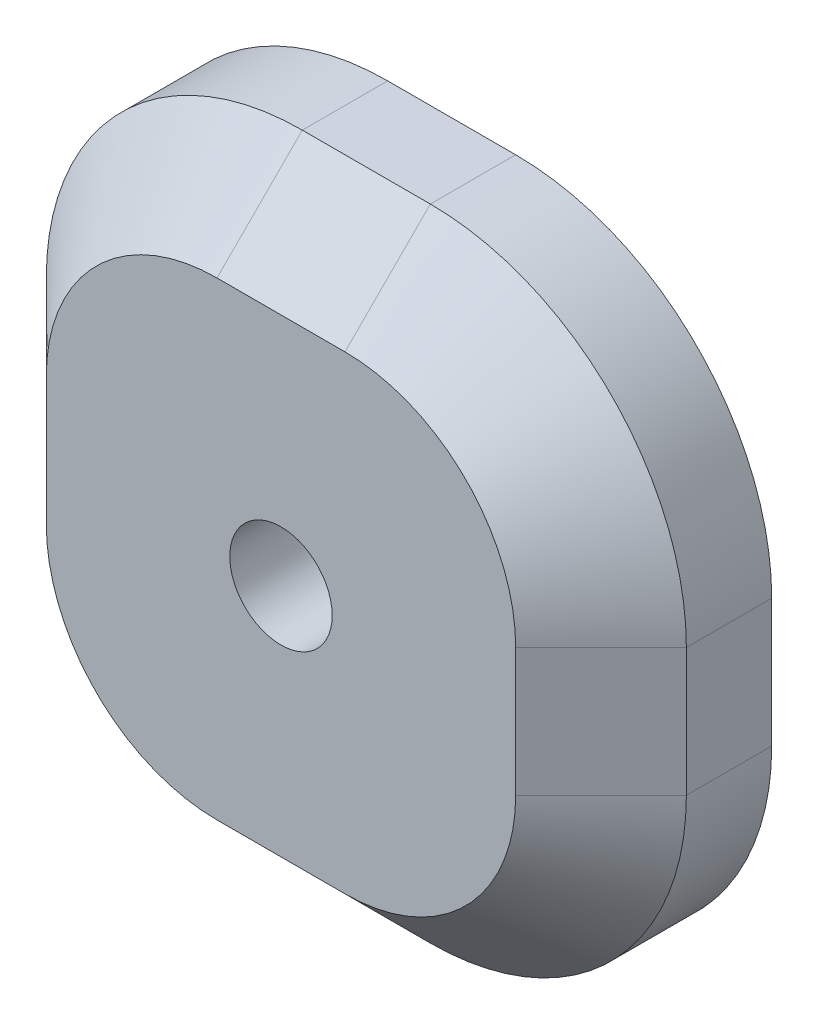
ISO-10303-21;
HEADER;
FILE_DESCRIPTION(('STEP AP214'),'2;1');
FILE_NAME('part.step','',(''),(''),'','','');
FILE_SCHEMA(('AUTOMOTIVE_DESIGN { 1 0 10303 214 1 1 1 1 }'));
ENDSEC;
DATA;
#1=APPLICATION_CONTEXT('core data for automotive mechanical design processes');
#2=APPLICATION_PROTOCOL_DEFINITION('international standard','automotive_design',2000,#1);
#3=PRODUCT_CONTEXT('',#1,'mechanical');
#4=PRODUCT('Part','Part','',(#3));
#5=PRODUCT_RELATED_PRODUCT_CATEGORY('part','',(#4));
#6=PRODUCT_DEFINITION_FORMATION('','',#4);
#7=PRODUCT_DEFINITION_CONTEXT('part definition',#1,'design');
#8=PRODUCT_DEFINITION('design','',#6,#7);
#9=PRODUCT_DEFINITION_SHAPE('','',#8);
#10=(LENGTH_UNIT() NAMED_UNIT(*) SI_UNIT(.MILLI.,.METRE.));
#11=(NAMED_UNIT(*) PLANE_ANGLE_UNIT() SI_UNIT($,.RADIAN.));
#12=(NAMED_UNIT(*) SI_UNIT($,.STERADIAN.) SOLID_ANGLE_UNIT());
#13=UNCERTAINTY_MEASURE_WITH_UNIT(LENGTH_MEASURE(1.E-05),#10,'distance_accuracy_value','');
#14=(GEOMETRIC_REPRESENTATION_CONTEXT(3) GLOBAL_UNCERTAINTY_ASSIGNED_CONTEXT((#13)) GLOBAL_UNIT_ASSIGNED_CONTEXT((#10,
#11,#12)) REPRESENTATION_CONTEXT('',''));
#15=CARTESIAN_POINT('',(0.,0.,0.));
#16=DIRECTION('',(0.,0.,1.));
#17=DIRECTION('',(1.,0.,0.));
#18=AXIS2_PLACEMENT_3D('',#15,#16,#17);
#19=CARTESIAN_POINT('',(-7.5,-7.5,20.));
#20=DIRECTION('',(0.,0.,-1.));
#21=DIRECTION('',(-1.,0.,0.));
#22=AXIS2_PLACEMENT_3D('',#19,#20,#21);
#23=CYLINDRICAL_SURFACE('',#22,30.);
#24=DIRECTION('',(0.,0.,-1.));
#25=VECTOR('',#24,1.);
#26=CARTESIAN_POINT('',(-7.5,-37.5,20.));
#27=LINE('',#26,#25);
#28=CARTESIAN_POINT('',(-7.5,-37.5,9.99999999999995));
#29=VERTEX_POINT('',#28);
#30=CARTESIAN_POINT('',(-7.5,-37.5,0.));
#31=VERTEX_POINT('',#30);
#32=EDGE_CURVE('E249',#29,#31,#27,.T.);
#33=ORIENTED_EDGE('',*,*,#32,.F.);
#34=CARTESIAN_POINT('',(-7.5,-7.5,9.99999999999995));
#35=DIRECTION('',(0.,0.,1.));
#36=DIRECTION('',(1.,0.,0.));
#37=AXIS2_PLACEMENT_3D('',#34,#35,#36);
#38=CIRCLE('',#37,30.);
#39=CARTESIAN_POINT('',(-37.5,-7.5,9.99999999999995));
#40=VERTEX_POINT('',#39);
#41=EDGE_CURVE('E52',#29,#40,#38,.F.);
#42=ORIENTED_EDGE('',*,*,#41,.T.);
#43=DIRECTION('',(0.,0.,-1.));
#44=VECTOR('',#43,1.);
#45=CARTESIAN_POINT('',(-37.5,-7.5,20.));
#46=LINE('',#45,#44);
#47=CARTESIAN_POINT('',(-37.5,-7.5,0.));
#48=VERTEX_POINT('',#47);
#49=EDGE_CURVE('E228',#40,#48,#46,.T.);
#50=ORIENTED_EDGE('',*,*,#49,.T.);
#51=CARTESIAN_POINT('',(-7.5,-7.5,0.));
#52=DIRECTION('',(0.,0.,1.));
#53=DIRECTION('',(1.,0.,0.));
#54=AXIS2_PLACEMENT_3D('',#51,#52,#53);
#55=CIRCLE('',#54,30.);
#56=EDGE_CURVE('E196',#48,#31,#55,.T.);
#57=ORIENTED_EDGE('',*,*,#56,.T.);
#58=EDGE_LOOP('',(#33,#42,#50,#57));
#59=FACE_BOUND('',#58,.T.);
#60=ADVANCED_FACE('F41',(#59),#23,.T.);
#61=CARTESIAN_POINT('',(-7.5,-37.5,20.));
#62=DIRECTION('',(0.,1.,0.));
#63=DIRECTION('',(0.,0.,1.));
#64=AXIS2_PLACEMENT_3D('',#61,#62,#63);
#65=PLANE('',#64);
#66=DIRECTION('',(0.,0.,-1.));
#67=VECTOR('',#66,1.);
#68=CARTESIAN_POINT('',(7.5,-37.5,20.));
#69=LINE('',#68,#67);
#70=CARTESIAN_POINT('',(7.5,-37.5,9.99999999999995));
#71=VERTEX_POINT('',#70);
#72=CARTESIAN_POINT('',(7.5,-37.5,0.));
#73=VERTEX_POINT('',#72);
#74=EDGE_CURVE('E246',#71,#73,#69,.T.);
#75=ORIENTED_EDGE('',*,*,#74,.F.);
#76=DIRECTION('',(-1.,0.,0.));
#77=VECTOR('',#76,1.);
#78=CARTESIAN_POINT('',(-7.5,-37.5,9.99999999999995));
#79=LINE('',#78,#77);
#80=EDGE_CURVE('E11',#71,#29,#79,.T.);
#81=ORIENTED_EDGE('',*,*,#80,.T.);
#82=ORIENTED_EDGE('',*,*,#32,.T.);
#83=DIRECTION('',(1.,0.,0.));
#84=VECTOR('',#83,1.);
#85=CARTESIAN_POINT('',(-7.5,-37.5,0.));
#86=LINE('',#85,#84);
#87=EDGE_CURVE('E200',#31,#73,#86,.T.);
#88=ORIENTED_EDGE('',*,*,#87,.T.);
#89=EDGE_LOOP('',(#75,#81,#82,#88));
#90=FACE_BOUND('',#89,.T.);
#91=ADVANCED_FACE('F400',(#90),#65,.F.);
#92=CARTESIAN_POINT('',(7.50000000000001,-7.5,20.));
#93=DIRECTION('',(0.,0.,-1.));
#94=DIRECTION('',(-1.,0.,0.));
#95=AXIS2_PLACEMENT_3D('',#92,#93,#94);
#96=CYLINDRICAL_SURFACE('',#95,30.);
#97=DIRECTION('',(0.,0.,-1.));
#98=VECTOR('',#97,1.);
#99=CARTESIAN_POINT('',(37.5,-7.5,20.));
#100=LINE('',#99,#98);
#101=CARTESIAN_POINT('',(37.5,-7.5,9.99999999999995));
#102=VERTEX_POINT('',#101);
#103=CARTESIAN_POINT('',(37.5,-7.5,0.));
#104=VERTEX_POINT('',#103);
#105=EDGE_CURVE('E243',#102,#104,#100,.T.);
#106=ORIENTED_EDGE('',*,*,#105,.F.);
#107=CARTESIAN_POINT('',(7.50000000000001,-7.5,9.99999999999995));
#108=DIRECTION('',(0.,0.,1.));
#109=DIRECTION('',(1.,0.,0.));
#110=AXIS2_PLACEMENT_3D('',#107,#108,#109);
#111=CIRCLE('',#110,30.);
#112=EDGE_CURVE('E66',#102,#71,#111,.F.);
#113=ORIENTED_EDGE('',*,*,#112,.T.);
#114=ORIENTED_EDGE('',*,*,#74,.T.);
#115=CARTESIAN_POINT('',(7.50000000000001,-7.5,0.));
#116=DIRECTION('',(0.,0.,1.));
#117=DIRECTION('',(1.,0.,0.));
#118=AXIS2_PLACEMENT_3D('',#115,#116,#117);
#119=CIRCLE('',#118,30.);
#120=EDGE_CURVE('E204',#73,#104,#119,.T.);
#121=ORIENTED_EDGE('',*,*,#120,.T.);
#122=EDGE_LOOP('',(#106,#113,#114,#121));
#123=FACE_BOUND('',#122,.T.);
#124=ADVANCED_FACE('F337',(#123),#96,.T.);
#125=CARTESIAN_POINT('',(37.5,7.50000000000001,20.));
#126=DIRECTION('',(-1.,0.,0.));
#127=DIRECTION('',(0.,-1.,0.));
#128=AXIS2_PLACEMENT_3D('',#125,#126,#127);
#129=PLANE('',#128);
#130=DIRECTION('',(0.,0.,-1.));
#131=VECTOR('',#130,1.);
#132=CARTESIAN_POINT('',(37.5,7.5,20.));
#133=LINE('',#132,#131);
#134=CARTESIAN_POINT('',(37.5,7.5,9.99999999999995));
#135=VERTEX_POINT('',#134);
#136=CARTESIAN_POINT('',(37.5,7.5,0.));
#137=VERTEX_POINT('',#136);
#138=EDGE_CURVE('E240',#135,#137,#133,.T.);
#139=ORIENTED_EDGE('',*,*,#138,.F.);
#140=DIRECTION('',(0.,-1.,0.));
#141=VECTOR('',#140,1.);
#142=CARTESIAN_POINT('',(37.5,-7.5,9.99999999999995));
#143=LINE('',#142,#141);
#144=EDGE_CURVE('E290',#135,#102,#143,.T.);
#145=ORIENTED_EDGE('',*,*,#144,.T.);
#146=ORIENTED_EDGE('',*,*,#105,.T.);
#147=DIRECTION('',(0.,1.,0.));
#148=VECTOR('',#147,1.);
#149=CARTESIAN_POINT('',(37.5,7.50000000000001,0.));
#150=LINE('',#149,#148);
#151=EDGE_CURVE('E208',#104,#137,#150,.T.);
#152=ORIENTED_EDGE('',*,*,#151,.T.);
#153=EDGE_LOOP('',(#139,#145,#146,#152));
#154=FACE_BOUND('',#153,.T.);
#155=ADVANCED_FACE('F336',(#154),#129,.F.);
#156=CARTESIAN_POINT('',(7.49999999999999,7.5,20.));
#157=DIRECTION('',(0.,0.,-1.));
#158=DIRECTION('',(-1.,0.,0.));
#159=AXIS2_PLACEMENT_3D('',#156,#157,#158);
#160=CYLINDRICAL_SURFACE('',#159,30.);
#161=DIRECTION('',(0.,0.,-1.));
#162=VECTOR('',#161,1.);
#163=CARTESIAN_POINT('',(7.49999999999999,37.5,20.));
#164=LINE('',#163,#162);
#165=CARTESIAN_POINT('',(7.49999999999999,37.5,9.99999999999995));
#166=VERTEX_POINT('',#165);
#167=CARTESIAN_POINT('',(7.49999999999999,37.5,0.));
#168=VERTEX_POINT('',#167);
#169=EDGE_CURVE('E237',#166,#168,#164,.T.);
#170=ORIENTED_EDGE('',*,*,#169,.F.);
#171=CARTESIAN_POINT('',(7.49999999999999,7.5,9.99999999999995));
#172=DIRECTION('',(0.,0.,1.));
#173=DIRECTION('',(1.,0.,0.));
#174=AXIS2_PLACEMENT_3D('',#171,#172,#173);
#175=CIRCLE('',#174,30.);
#176=EDGE_CURVE('E287',#166,#135,#175,.F.);
#177=ORIENTED_EDGE('',*,*,#176,.T.);
#178=ORIENTED_EDGE('',*,*,#138,.T.);
#179=CARTESIAN_POINT('',(7.49999999999999,7.5,0.));
#180=DIRECTION('',(0.,0.,1.));
#181=DIRECTION('',(-1.,0.,0.));
#182=AXIS2_PLACEMENT_3D('',#179,#180,#181);
#183=CIRCLE('',#182,30.);
#184=EDGE_CURVE('E212',#137,#168,#183,.T.);
#185=ORIENTED_EDGE('',*,*,#184,.T.);
#186=EDGE_LOOP('',(#170,#177,#178,#185));
#187=FACE_BOUND('',#186,.T.);
#188=ADVANCED_FACE('F349',(#187),#160,.T.);
#189=CARTESIAN_POINT('',(-7.5,37.5,20.));
#190=DIRECTION('',(0.,-1.,0.));
#191=DIRECTION('',(0.,0.,-1.));
#192=AXIS2_PLACEMENT_3D('',#189,#190,#191);
#193=PLANE('',#192);
#194=DIRECTION('',(0.,0.,-1.));
#195=VECTOR('',#194,1.);
#196=CARTESIAN_POINT('',(-7.5,37.5,20.));
#197=LINE('',#196,#195);
#198=CARTESIAN_POINT('',(-7.5,37.5,9.99999999999995));
#199=VERTEX_POINT('',#198);
#200=CARTESIAN_POINT('',(-7.5,37.5,0.));
#201=VERTEX_POINT('',#200);
#202=EDGE_CURVE('E234',#199,#201,#197,.T.);
#203=ORIENTED_EDGE('',*,*,#202,.F.);
#204=DIRECTION('',(1.,0.,0.));
#205=VECTOR('',#204,1.);
#206=CARTESIAN_POINT('',(7.49999999999999,37.5,9.99999999999995));
#207=LINE('',#206,#205);
#208=EDGE_CURVE('E284',#199,#166,#207,.T.);
#209=ORIENTED_EDGE('',*,*,#208,.T.);
#210=ORIENTED_EDGE('',*,*,#169,.T.);
#211=DIRECTION('',(-1.,0.,0.));
#212=VECTOR('',#211,1.);
#213=CARTESIAN_POINT('',(-7.5,37.5,0.));
#214=LINE('',#213,#212);
#215=EDGE_CURVE('E216',#168,#201,#214,.T.);
#216=ORIENTED_EDGE('',*,*,#215,.T.);
#217=EDGE_LOOP('',(#203,#209,#210,#216));
#218=FACE_BOUND('',#217,.T.);
#219=ADVANCED_FACE('F352',(#218),#193,.F.);
#220=CARTESIAN_POINT('',(-7.5,7.5,20.));
#221=DIRECTION('',(0.,0.,-1.));
#222=DIRECTION('',(-1.,0.,0.));
#223=AXIS2_PLACEMENT_3D('',#220,#221,#222);
#224=CYLINDRICAL_SURFACE('',#223,30.);
#225=DIRECTION('',(0.,0.,-1.));
#226=VECTOR('',#225,1.);
#227=CARTESIAN_POINT('',(-37.5,7.49999999999999,20.));
#228=LINE('',#227,#226);
#229=CARTESIAN_POINT('',(-37.5,7.49999999999999,9.99999999999995));
#230=VERTEX_POINT('',#229);
#231=CARTESIAN_POINT('',(-37.5,7.49999999999999,0.));
#232=VERTEX_POINT('',#231);
#233=EDGE_CURVE('E231',#230,#232,#228,.T.);
#234=ORIENTED_EDGE('',*,*,#233,.F.);
#235=CARTESIAN_POINT('',(-7.5,7.5,9.99999999999995));
#236=DIRECTION('',(0.,0.,1.));
#237=DIRECTION('',(1.,0.,0.));
#238=AXIS2_PLACEMENT_3D('',#235,#236,#237);
#239=CIRCLE('',#238,30.);
#240=EDGE_CURVE('E281',#230,#199,#239,.F.);
#241=ORIENTED_EDGE('',*,*,#240,.T.);
#242=ORIENTED_EDGE('',*,*,#202,.T.);
#243=CARTESIAN_POINT('',(-7.5,7.5,0.));
#244=DIRECTION('',(0.,0.,1.));
#245=DIRECTION('',(1.,0.,0.));
#246=AXIS2_PLACEMENT_3D('',#243,#244,#245);
#247=CIRCLE('',#246,30.);
#248=EDGE_CURVE('E220',#201,#232,#247,.T.);
#249=ORIENTED_EDGE('',*,*,#248,.T.);
#250=EDGE_LOOP('',(#234,#241,#242,#249));
#251=FACE_BOUND('',#250,.T.);
#252=ADVANCED_FACE('F414',(#251),#224,.T.);
#253=CARTESIAN_POINT('',(-37.5,7.49999999999999,20.));
#254=DIRECTION('',(1.,0.,0.));
#255=DIRECTION('',(0.,1.,0.));
#256=AXIS2_PLACEMENT_3D('',#253,#254,#255);
#257=PLANE('',#256);
#258=ORIENTED_EDGE('',*,*,#49,.F.);
#259=DIRECTION('',(0.,1.,0.));
#260=VECTOR('',#259,1.);
#261=CARTESIAN_POINT('',(-37.5,7.49999999999999,9.99999999999995));
#262=LINE('',#261,#260);
#263=EDGE_CURVE('E277',#40,#230,#262,.T.);
#264=ORIENTED_EDGE('',*,*,#263,.T.);
#265=ORIENTED_EDGE('',*,*,#233,.T.);
#266=DIRECTION('',(0.,-1.,0.));
#267=VECTOR('',#266,1.);
#268=CARTESIAN_POINT('',(-37.5,7.49999999999999,0.));
#269=LINE('',#268,#267);
#270=EDGE_CURVE('E224',#232,#48,#269,.T.);
#271=ORIENTED_EDGE('',*,*,#270,.T.);
#272=EDGE_LOOP('',(#258,#264,#265,#271));
#273=FACE_BOUND('',#272,.T.);
#274=ADVANCED_FACE('F381',(#273),#257,.F.);
#275=CARTESIAN_POINT('',(-7.5,-7.5,20.));
#276=DIRECTION('',(0.,0.,1.));
#277=DIRECTION('',(1.,0.,0.));
#278=AXIS2_PLACEMENT_3D('',#275,#276,#277);
#279=PLANE('',#278);
#280=CARTESIAN_POINT('',(0.,0.,20.));
#281=DIRECTION('',(0.,0.,1.));
#282=DIRECTION('',(1.,0.,0.));
#283=AXIS2_PLACEMENT_3D('',#280,#281,#282);
#284=CIRCLE('',#283,6.);
#285=CARTESIAN_POINT('',(6.,0.,20.));
#286=VERTEX_POINT('',#285);
#287=EDGE_CURVE('E158',#286,#286,#284,.T.);
#288=ORIENTED_EDGE('',*,*,#287,.F.);
#289=EDGE_LOOP('',(#288));
#290=FACE_BOUND('',#289,.T.);
#291=CARTESIAN_POINT('',(-7.5,7.5,20.));
#292=DIRECTION('',(0.,0.,1.));
#293=DIRECTION('',(1.,0.,0.));
#294=AXIS2_PLACEMENT_3D('',#291,#292,#293);
#295=CIRCLE('',#294,20.);
#296=CARTESIAN_POINT('',(-7.5,27.5,20.));
#297=VERTEX_POINT('',#296);
#298=CARTESIAN_POINT('',(-27.5,7.5,20.));
#299=VERTEX_POINT('',#298);
#300=EDGE_CURVE('E270',#297,#299,#295,.T.);
#301=ORIENTED_EDGE('',*,*,#300,.T.);
#302=DIRECTION('',(0.,-1.,0.));
#303=VECTOR('',#302,1.);
#304=CARTESIAN_POINT('',(-27.5,-7.5,20.));
#305=LINE('',#304,#303);
#306=CARTESIAN_POINT('',(-27.5,-7.5,20.));
#307=VERTEX_POINT('',#306);
#308=EDGE_CURVE('E273',#299,#307,#305,.T.);
#309=ORIENTED_EDGE('',*,*,#308,.T.);
#310=CARTESIAN_POINT('',(-7.5,-7.5,20.));
#311=DIRECTION('',(0.,0.,1.));
#312=DIRECTION('',(1.,0.,0.));
#313=AXIS2_PLACEMENT_3D('',#310,#311,#312);
#314=CIRCLE('',#313,20.);
#315=CARTESIAN_POINT('',(-7.5,-27.5,20.));
#316=VERTEX_POINT('',#315);
#317=EDGE_CURVE('E255',#307,#316,#314,.T.);
#318=ORIENTED_EDGE('',*,*,#317,.T.);
#319=DIRECTION('',(1.,0.,0.));
#320=VECTOR('',#319,1.);
#321=CARTESIAN_POINT('',(7.5,-27.5,20.));
#322=LINE('',#321,#320);
#323=CARTESIAN_POINT('',(7.5,-27.5,20.));
#324=VERTEX_POINT('',#323);
#325=EDGE_CURVE('E252',#316,#324,#322,.T.);
#326=ORIENTED_EDGE('',*,*,#325,.T.);
#327=CARTESIAN_POINT('',(7.50000000000001,-7.5,20.));
#328=DIRECTION('',(0.,0.,1.));
#329=DIRECTION('',(1.,0.,0.));
#330=AXIS2_PLACEMENT_3D('',#327,#328,#329);
#331=CIRCLE('',#330,20.);
#332=CARTESIAN_POINT('',(27.5,-7.5,20.));
#333=VERTEX_POINT('',#332);
#334=EDGE_CURVE('E258',#324,#333,#331,.T.);
#335=ORIENTED_EDGE('',*,*,#334,.T.);
#336=DIRECTION('',(0.,1.,0.));
#337=VECTOR('',#336,1.);
#338=CARTESIAN_POINT('',(27.5,7.5,20.));
#339=LINE('',#338,#337);
#340=CARTESIAN_POINT('',(27.5,7.5,20.));
#341=VERTEX_POINT('',#340);
#342=EDGE_CURVE('E261',#333,#341,#339,.T.);
#343=ORIENTED_EDGE('',*,*,#342,.T.);
#344=CARTESIAN_POINT('',(7.49999999999999,7.5,20.));
#345=DIRECTION('',(0.,0.,1.));
#346=DIRECTION('',(1.,0.,0.));
#347=AXIS2_PLACEMENT_3D('',#344,#345,#346);
#348=CIRCLE('',#347,20.);
#349=CARTESIAN_POINT('',(7.49999999999999,27.5,20.));
#350=VERTEX_POINT('',#349);
#351=EDGE_CURVE('E264',#341,#350,#348,.T.);
#352=ORIENTED_EDGE('',*,*,#351,.T.);
#353=DIRECTION('',(-1.,0.,0.));
#354=VECTOR('',#353,1.);
#355=CARTESIAN_POINT('',(-7.5,27.5,20.));
#356=LINE('',#355,#354);
#357=EDGE_CURVE('E267',#350,#297,#356,.T.);
#358=ORIENTED_EDGE('',*,*,#357,.T.);
#359=EDGE_LOOP('',(#301,#309,#318,#326,#335,#343,#352,#358));
#360=FACE_BOUND('',#359,.T.);
#361=ADVANCED_FACE('F365',(#290,#360),#279,.T.);
#362=CARTESIAN_POINT('',(-7.5,-7.5,0.));
#363=DIRECTION('',(0.,0.,1.));
#364=DIRECTION('',(1.,0.,0.));
#365=AXIS2_PLACEMENT_3D('',#362,#363,#364);
#366=PLANE('',#365);
#367=CARTESIAN_POINT('',(12.5,12.5,0.));
#368=DIRECTION('',(0.,0.,-1.));
#369=DIRECTION('',(-1.,0.,0.));
#370=AXIS2_PLACEMENT_3D('',#367,#368,#369);
#371=CIRCLE('',#370,6.);
#372=CARTESIAN_POINT('',(6.5,12.5,0.));
#373=VERTEX_POINT('',#372);
#374=EDGE_CURVE('E157',#373,#373,#371,.T.);
#375=ORIENTED_EDGE('',*,*,#374,.F.);
#376=EDGE_LOOP('',(#375));
#377=FACE_BOUND('',#376,.T.);
#378=CARTESIAN_POINT('',(12.5,-12.5,0.));
#379=DIRECTION('',(0.,0.,-1.));
#380=DIRECTION('',(-1.,0.,0.));
#381=AXIS2_PLACEMENT_3D('',#378,#379,#380);
#382=CIRCLE('',#381,6.);
#383=CARTESIAN_POINT('',(6.50000000000001,-12.5,0.));
#384=VERTEX_POINT('',#383);
#385=EDGE_CURVE('E171',#384,#384,#382,.T.);
#386=ORIENTED_EDGE('',*,*,#385,.F.);
#387=EDGE_LOOP('',(#386));
#388=FACE_BOUND('',#387,.T.);
#389=CARTESIAN_POINT('',(-12.5,-12.5,0.));
#390=DIRECTION('',(0.,0.,-1.));
#391=DIRECTION('',(-1.,0.,0.));
#392=AXIS2_PLACEMENT_3D('',#389,#390,#391);
#393=CIRCLE('',#392,6.);
#394=CARTESIAN_POINT('',(-18.5,-12.5,0.));
#395=VERTEX_POINT('',#394);
#396=EDGE_CURVE('E179',#395,#395,#393,.T.);
#397=ORIENTED_EDGE('',*,*,#396,.F.);
#398=EDGE_LOOP('',(#397));
#399=FACE_BOUND('',#398,.T.);
#400=CARTESIAN_POINT('',(-12.5,12.5,0.));
#401=DIRECTION('',(0.,0.,-1.));
#402=DIRECTION('',(-1.,0.,0.));
#403=AXIS2_PLACEMENT_3D('',#400,#401,#402);
#404=CIRCLE('',#403,6.);
#405=CARTESIAN_POINT('',(-18.5,12.5,0.));
#406=VERTEX_POINT('',#405);
#407=EDGE_CURVE('E187',#406,#406,#404,.T.);
#408=ORIENTED_EDGE('',*,*,#407,.F.);
#409=EDGE_LOOP('',(#408));
#410=FACE_BOUND('',#409,.T.);
#411=ORIENTED_EDGE('',*,*,#56,.F.);
#412=ORIENTED_EDGE('',*,*,#270,.F.);
#413=ORIENTED_EDGE('',*,*,#248,.F.);
#414=ORIENTED_EDGE('',*,*,#215,.F.);
#415=ORIENTED_EDGE('',*,*,#184,.F.);
#416=ORIENTED_EDGE('',*,*,#151,.F.);
#417=ORIENTED_EDGE('',*,*,#120,.F.);
#418=ORIENTED_EDGE('',*,*,#87,.F.);
#419=EDGE_LOOP('',(#411,#412,#413,#414,#415,#416,#417,#418));
#420=FACE_BOUND('',#419,.T.);
#421=ADVANCED_FACE('F344',(#377,#388,#399,#410,#420),#366,.F.);
#422=CARTESIAN_POINT('',(27.5,-7.49999999999998,20.));
#423=DIRECTION('',(0.707106781186549,0.,0.707106781186546));
#424=DIRECTION('',(0.,-1.,0.));
#425=AXIS2_PLACEMENT_3D('',#422,#423,#424);
#426=PLANE('',#425);
#427=DIRECTION('',(-0.707106781186546,0.,0.707106781186549));
#428=VECTOR('',#427,1.);
#429=CARTESIAN_POINT('',(37.5,-7.5,9.99999999999995));
#430=LINE('',#429,#428);
#431=EDGE_CURVE('E317',#102,#333,#430,.T.);
#432=ORIENTED_EDGE('',*,*,#431,.F.);
#433=ORIENTED_EDGE('',*,*,#144,.F.);
#434=DIRECTION('',(0.707106781186546,0.,-0.707106781186549));
#435=VECTOR('',#434,1.);
#436=CARTESIAN_POINT('',(27.5,7.5,20.));
#437=LINE('',#436,#435);
#438=EDGE_CURVE('E46',#341,#135,#437,.T.);
#439=ORIENTED_EDGE('',*,*,#438,.F.);
#440=ORIENTED_EDGE('',*,*,#342,.F.);
#441=EDGE_LOOP('',(#432,#433,#439,#440));
#442=FACE_BOUND('',#441,.T.);
#443=ADVANCED_FACE('F44',(#442),#426,.T.);
#444=CARTESIAN_POINT('',(7.49999999999999,7.5,20.));
#445=DIRECTION('',(0.,0.,-1.));
#446=DIRECTION('',(-1.,0.,0.));
#447=AXIS2_PLACEMENT_3D('',#444,#445,#446);
#448=CONICAL_SURFACE('',#447,20.,0.785398163397446);
#449=ORIENTED_EDGE('',*,*,#438,.T.);
#450=ORIENTED_EDGE('',*,*,#176,.F.);
#451=DIRECTION('',(0.,0.707106781186546,-0.707106781186549));
#452=VECTOR('',#451,1.);
#453=CARTESIAN_POINT('',(7.49999999999999,27.5,20.));
#454=LINE('',#453,#452);
#455=EDGE_CURVE('E314',#350,#166,#454,.T.);
#456=ORIENTED_EDGE('',*,*,#455,.F.);
#457=ORIENTED_EDGE('',*,*,#351,.F.);
#458=EDGE_LOOP('',(#449,#450,#456,#457));
#459=FACE_BOUND('',#458,.T.);
#460=ADVANCED_FACE('F329',(#459),#448,.T.);
#461=CARTESIAN_POINT('',(7.50000000000001,-7.5,20.));
#462=DIRECTION('',(0.,0.,-1.));
#463=DIRECTION('',(-1.,0.,0.));
#464=AXIS2_PLACEMENT_3D('',#461,#462,#463);
#465=CONICAL_SURFACE('',#464,20.,0.785398163397446);
#466=ORIENTED_EDGE('',*,*,#431,.T.);
#467=ORIENTED_EDGE('',*,*,#334,.F.);
#468=DIRECTION('',(0.,0.707106781186546,0.707106781186549));
#469=VECTOR('',#468,1.);
#470=CARTESIAN_POINT('',(7.5,-37.5,9.99999999999995));
#471=LINE('',#470,#469);
#472=EDGE_CURVE('E310',#71,#324,#471,.T.);
#473=ORIENTED_EDGE('',*,*,#472,.F.);
#474=ORIENTED_EDGE('',*,*,#112,.F.);
#475=EDGE_LOOP('',(#466,#467,#473,#474));
#476=FACE_BOUND('',#475,.T.);
#477=ADVANCED_FACE('F368',(#476),#465,.T.);
#478=CARTESIAN_POINT('',(-7.5,27.5,20.));
#479=DIRECTION('',(0.,0.707106781186549,0.707106781186546));
#480=DIRECTION('',(1.,0.,0.));
#481=AXIS2_PLACEMENT_3D('',#478,#479,#480);
#482=PLANE('',#481);
#483=ORIENTED_EDGE('',*,*,#455,.T.);
#484=ORIENTED_EDGE('',*,*,#208,.F.);
#485=DIRECTION('',(0.,0.707106781186546,-0.707106781186549));
#486=VECTOR('',#485,1.);
#487=CARTESIAN_POINT('',(-7.5,27.5,20.));
#488=LINE('',#487,#486);
#489=EDGE_CURVE('E306',#297,#199,#488,.T.);
#490=ORIENTED_EDGE('',*,*,#489,.F.);
#491=ORIENTED_EDGE('',*,*,#357,.F.);
#492=EDGE_LOOP('',(#483,#484,#490,#491));
#493=FACE_BOUND('',#492,.T.);
#494=ADVANCED_FACE('F356',(#493),#482,.T.);
#495=CARTESIAN_POINT('',(-7.5,-27.5,20.));
#496=DIRECTION('',(0.,-0.707106781186549,0.707106781186546));
#497=DIRECTION('',(-1.,0.,0.));
#498=AXIS2_PLACEMENT_3D('',#495,#496,#497);
#499=PLANE('',#498);
#500=ORIENTED_EDGE('',*,*,#472,.T.);
#501=ORIENTED_EDGE('',*,*,#325,.F.);
#502=DIRECTION('',(0.,0.707106781186546,0.707106781186549));
#503=VECTOR('',#502,1.);
#504=CARTESIAN_POINT('',(-7.5,-37.5,9.99999999999995));
#505=LINE('',#504,#503);
#506=EDGE_CURVE('E302',#29,#316,#505,.T.);
#507=ORIENTED_EDGE('',*,*,#506,.F.);
#508=ORIENTED_EDGE('',*,*,#80,.F.);
#509=EDGE_LOOP('',(#500,#501,#507,#508));
#510=FACE_BOUND('',#509,.T.);
#511=ADVANCED_FACE('F370',(#510),#499,.T.);
#512=CARTESIAN_POINT('',(-7.5,7.5,20.));
#513=DIRECTION('',(0.,0.,-1.));
#514=DIRECTION('',(-1.,0.,0.));
#515=AXIS2_PLACEMENT_3D('',#512,#513,#514);
#516=CONICAL_SURFACE('',#515,20.,0.785398163397446);
#517=ORIENTED_EDGE('',*,*,#489,.T.);
#518=ORIENTED_EDGE('',*,*,#240,.F.);
#519=DIRECTION('',(-0.707106781186546,0.,-0.707106781186549));
#520=VECTOR('',#519,1.);
#521=CARTESIAN_POINT('',(-27.5,7.5,20.));
#522=LINE('',#521,#520);
#523=EDGE_CURVE('E299',#299,#230,#522,.T.);
#524=ORIENTED_EDGE('',*,*,#523,.F.);
#525=ORIENTED_EDGE('',*,*,#300,.F.);
#526=EDGE_LOOP('',(#517,#518,#524,#525));
#527=FACE_BOUND('',#526,.T.);
#528=ADVANCED_FACE('F361',(#527),#516,.T.);
#529=CARTESIAN_POINT('',(-7.5,-7.5,20.));
#530=DIRECTION('',(0.,0.,-1.));
#531=DIRECTION('',(-1.,0.,0.));
#532=AXIS2_PLACEMENT_3D('',#529,#530,#531);
#533=CONICAL_SURFACE('',#532,20.,0.785398163397446);
#534=ORIENTED_EDGE('',*,*,#506,.T.);
#535=ORIENTED_EDGE('',*,*,#317,.F.);
#536=DIRECTION('',(0.707106781186546,0.,0.707106781186549));
#537=VECTOR('',#536,1.);
#538=CARTESIAN_POINT('',(-37.5,-7.5,9.99999999999995));
#539=LINE('',#538,#537);
#540=EDGE_CURVE('E195',#40,#307,#539,.T.);
#541=ORIENTED_EDGE('',*,*,#540,.F.);
#542=ORIENTED_EDGE('',*,*,#41,.F.);
#543=EDGE_LOOP('',(#534,#535,#541,#542));
#544=FACE_BOUND('',#543,.T.);
#545=ADVANCED_FACE('F376',(#544),#533,.T.);
#546=CARTESIAN_POINT('',(-27.5,-7.50000000000001,20.));
#547=DIRECTION('',(-0.707106781186549,0.,0.707106781186546));
#548=DIRECTION('',(0.,1.,0.));
#549=AXIS2_PLACEMENT_3D('',#546,#547,#548);
#550=PLANE('',#549);
#551=ORIENTED_EDGE('',*,*,#523,.T.);
#552=ORIENTED_EDGE('',*,*,#263,.F.);
#553=ORIENTED_EDGE('',*,*,#540,.T.);
#554=ORIENTED_EDGE('',*,*,#308,.F.);
#555=EDGE_LOOP('',(#551,#552,#553,#554));
#556=FACE_BOUND('',#555,.T.);
#557=ADVANCED_FACE('F385',(#556),#550,.T.);
#558=CARTESIAN_POINT('',(-12.5,12.5,9.99999999999999));
#559=DIRECTION('',(0.,0.,-1.));
#560=DIRECTION('',(-1.,0.,0.));
#561=AXIS2_PLACEMENT_3D('',#558,#559,#560);
#562=CONICAL_SURFACE('',#561,6.,1.02974425867666);
#563=CARTESIAN_POINT('',(-12.5,12.5,13.6051637141653));
#564=VERTEX_POINT('',#563);
#565=VERTEX_LOOP('',#564);
#566=FACE_BOUND('',#565,.T.);
#567=CARTESIAN_POINT('',(-12.5,12.5,9.99999999999999));
#568=DIRECTION('',(0.,0.,-1.));
#569=DIRECTION('',(-1.,0.,0.));
#570=AXIS2_PLACEMENT_3D('',#567,#568,#569);
#571=CIRCLE('',#570,6.);
#572=CARTESIAN_POINT('',(-18.5,12.5,9.99999999999999));
#573=VERTEX_POINT('',#572);
#574=EDGE_CURVE('E191',#573,#573,#571,.T.);
#575=ORIENTED_EDGE('',*,*,#574,.T.);
#576=EDGE_LOOP('',(#575));
#577=FACE_BOUND('',#576,.T.);
#578=ADVANCED_FACE('F387',(#566,#577),#562,.F.);
#579=CARTESIAN_POINT('',(-12.5,12.5,0.));
#580=DIRECTION('',(0.,0.,-1.));
#581=DIRECTION('',(-1.,0.,0.));
#582=AXIS2_PLACEMENT_3D('',#579,#580,#581);
#583=CYLINDRICAL_SURFACE('',#582,6.);
#584=ORIENTED_EDGE('',*,*,#574,.F.);
#585=EDGE_LOOP('',(#584));
#586=FACE_BOUND('',#585,.T.);
#587=ORIENTED_EDGE('',*,*,#407,.T.);
#588=EDGE_LOOP('',(#587));
#589=FACE_BOUND('',#588,.T.);
#590=ADVANCED_FACE('F393',(#586,#589),#583,.F.);
#591=CARTESIAN_POINT('',(-12.5,-12.5,9.99999999999999));
#592=DIRECTION('',(0.,0.,-1.));
#593=DIRECTION('',(-1.,0.,0.));
#594=AXIS2_PLACEMENT_3D('',#591,#592,#593);
#595=CONICAL_SURFACE('',#594,6.,1.02974425867666);
#596=CARTESIAN_POINT('',(-12.5,-12.5,13.6051637141653));
#597=VERTEX_POINT('',#596);
#598=VERTEX_LOOP('',#597);
#599=FACE_BOUND('',#598,.T.);
#600=CARTESIAN_POINT('',(-12.5,-12.5,9.99999999999999));
#601=DIRECTION('',(0.,0.,-1.));
#602=DIRECTION('',(-1.,0.,0.));
#603=AXIS2_PLACEMENT_3D('',#600,#601,#602);
#604=CIRCLE('',#603,6.);
#605=CARTESIAN_POINT('',(-18.5,-12.5,9.99999999999999));
#606=VERTEX_POINT('',#605);
#607=EDGE_CURVE('E183',#606,#606,#604,.T.);
#608=ORIENTED_EDGE('',*,*,#607,.T.);
#609=EDGE_LOOP('',(#608));
#610=FACE_BOUND('',#609,.T.);
#611=ADVANCED_FACE('F428',(#599,#610),#595,.F.);
#612=CARTESIAN_POINT('',(-12.5,-12.5,0.));
#613=DIRECTION('',(0.,0.,-1.));
#614=DIRECTION('',(-1.,0.,0.));
#615=AXIS2_PLACEMENT_3D('',#612,#613,#614);
#616=CYLINDRICAL_SURFACE('',#615,6.);
#617=ORIENTED_EDGE('',*,*,#607,.F.);
#618=EDGE_LOOP('',(#617));
#619=FACE_BOUND('',#618,.T.);
#620=ORIENTED_EDGE('',*,*,#396,.T.);
#621=EDGE_LOOP('',(#620));
#622=FACE_BOUND('',#621,.T.);
#623=ADVANCED_FACE('F432',(#619,#622),#616,.F.);
#624=CARTESIAN_POINT('',(12.5,-12.5,9.99999999999999));
#625=DIRECTION('',(0.,0.,-1.));
#626=DIRECTION('',(-1.,0.,0.));
#627=AXIS2_PLACEMENT_3D('',#624,#625,#626);
#628=CONICAL_SURFACE('',#627,6.,1.02974425867666);
#629=CARTESIAN_POINT('',(12.5,-12.5,13.6051637141653));
#630=VERTEX_POINT('',#629);
#631=VERTEX_LOOP('',#630);
#632=FACE_BOUND('',#631,.T.);
#633=CARTESIAN_POINT('',(12.5,-12.5,9.99999999999999));
#634=DIRECTION('',(0.,0.,-1.));
#635=DIRECTION('',(-1.,0.,0.));
#636=AXIS2_PLACEMENT_3D('',#633,#634,#635);
#637=CIRCLE('',#636,6.);
#638=CARTESIAN_POINT('',(6.50000000000001,-12.5,9.99999999999999));
#639=VERTEX_POINT('',#638);
#640=EDGE_CURVE('E175',#639,#639,#637,.T.);
#641=ORIENTED_EDGE('',*,*,#640,.T.);
#642=EDGE_LOOP('',(#641));
#643=FACE_BOUND('',#642,.T.);
#644=ADVANCED_FACE('F436',(#632,#643),#628,.F.);
#645=CARTESIAN_POINT('',(12.5,-12.5,0.));
#646=DIRECTION('',(0.,0.,-1.));
#647=DIRECTION('',(-1.,0.,0.));
#648=AXIS2_PLACEMENT_3D('',#645,#646,#647);
#649=CYLINDRICAL_SURFACE('',#648,6.);
#650=ORIENTED_EDGE('',*,*,#640,.F.);
#651=EDGE_LOOP('',(#650));
#652=FACE_BOUND('',#651,.T.);
#653=ORIENTED_EDGE('',*,*,#385,.T.);
#654=EDGE_LOOP('',(#653));
#655=FACE_BOUND('',#654,.T.);
#656=ADVANCED_FACE('F440',(#652,#655),#649,.F.);
#657=CARTESIAN_POINT('',(12.5,12.5,9.99999999999999));
#658=DIRECTION('',(0.,0.,-1.));
#659=DIRECTION('',(-1.,0.,0.));
#660=AXIS2_PLACEMENT_3D('',#657,#658,#659);
#661=CONICAL_SURFACE('',#660,6.,1.02974425867666);
#662=CARTESIAN_POINT('',(12.5,12.5,13.6051637141653));
#663=VERTEX_POINT('',#662);
#664=VERTEX_LOOP('',#663);
#665=FACE_BOUND('',#664,.T.);
#666=CARTESIAN_POINT('',(12.5,12.5,9.99999999999999));
#667=DIRECTION('',(0.,0.,-1.));
#668=DIRECTION('',(-1.,0.,0.));
#669=AXIS2_PLACEMENT_3D('',#666,#667,#668);
#670=CIRCLE('',#669,6.);
#671=CARTESIAN_POINT('',(6.5,12.5,9.99999999999999));
#672=VERTEX_POINT('',#671);
#673=EDGE_CURVE('E163',#672,#672,#670,.T.);
#674=ORIENTED_EDGE('',*,*,#673,.T.);
#675=EDGE_LOOP('',(#674));
#676=FACE_BOUND('',#675,.T.);
#677=ADVANCED_FACE('F444',(#665,#676),#661,.F.);
#678=CARTESIAN_POINT('',(12.5,12.5,0.));
#679=DIRECTION('',(0.,0.,-1.));
#680=DIRECTION('',(-1.,0.,0.));
#681=AXIS2_PLACEMENT_3D('',#678,#679,#680);
#682=CYLINDRICAL_SURFACE('',#681,6.);
#683=ORIENTED_EDGE('',*,*,#673,.F.);
#684=EDGE_LOOP('',(#683));
#685=FACE_BOUND('',#684,.T.);
#686=ORIENTED_EDGE('',*,*,#374,.T.);
#687=EDGE_LOOP('',(#686));
#688=FACE_BOUND('',#687,.T.);
#689=ADVANCED_FACE('F150',(#685,#688),#682,.F.);
#690=CARTESIAN_POINT('',(0.,0.,10.));
#691=DIRECTION('',(0.,0.,1.));
#692=DIRECTION('',(1.,0.,0.));
#693=AXIS2_PLACEMENT_3D('',#690,#691,#692);
#694=CONICAL_SURFACE('',#693,6.,1.02974425867666);
#695=CARTESIAN_POINT('',(0.,0.,6.39483628583466));
#696=VERTEX_POINT('',#695);
#697=VERTEX_LOOP('',#696);
#698=FACE_BOUND('',#697,.T.);
#699=CARTESIAN_POINT('',(0.,0.,10.));
#700=DIRECTION('',(0.,0.,1.));
#701=DIRECTION('',(1.,0.,0.));
#702=AXIS2_PLACEMENT_3D('',#699,#700,#701);
#703=CIRCLE('',#702,6.);
#704=CARTESIAN_POINT('',(6.,0.,10.));
#705=VERTEX_POINT('',#704);
#706=EDGE_CURVE('E154',#705,#705,#703,.T.);
#707=ORIENTED_EDGE('',*,*,#706,.T.);
#708=EDGE_LOOP('',(#707));
#709=FACE_BOUND('',#708,.T.);
#710=ADVANCED_FACE('F146',(#698,#709),#694,.F.);
#711=CARTESIAN_POINT('',(0.,0.,20.));
#712=DIRECTION('',(0.,0.,1.));
#713=DIRECTION('',(1.,0.,0.));
#714=AXIS2_PLACEMENT_3D('',#711,#712,#713);
#715=CYLINDRICAL_SURFACE('',#714,6.);
#716=ORIENTED_EDGE('',*,*,#706,.F.);
#717=EDGE_LOOP('',(#716));
#718=FACE_BOUND('',#717,.T.);
#719=ORIENTED_EDGE('',*,*,#287,.T.);
#720=EDGE_LOOP('',(#719));
#721=FACE_BOUND('',#720,.T.);
#722=ADVANCED_FACE('F149',(#718,#721),#715,.F.);
#723=CLOSED_SHELL('',(#60,#91,#124,#155,#188,#219,#252,#274,#361,#421,#443,#460,#477,#494,#511,
#528,#545,#557,#578,#590,#611,#623,#644,#656,#677,#689,#710,#722));
#724=MANIFOLD_SOLID_BREP('B2',#723);
#725=ADVANCED_BREP_SHAPE_REPRESENTATION('',(#18,#724),#14);
#726=SHAPE_DEFINITION_REPRESENTATION(#9,#725);
ENDSEC;
END-ISO-10303-21;
